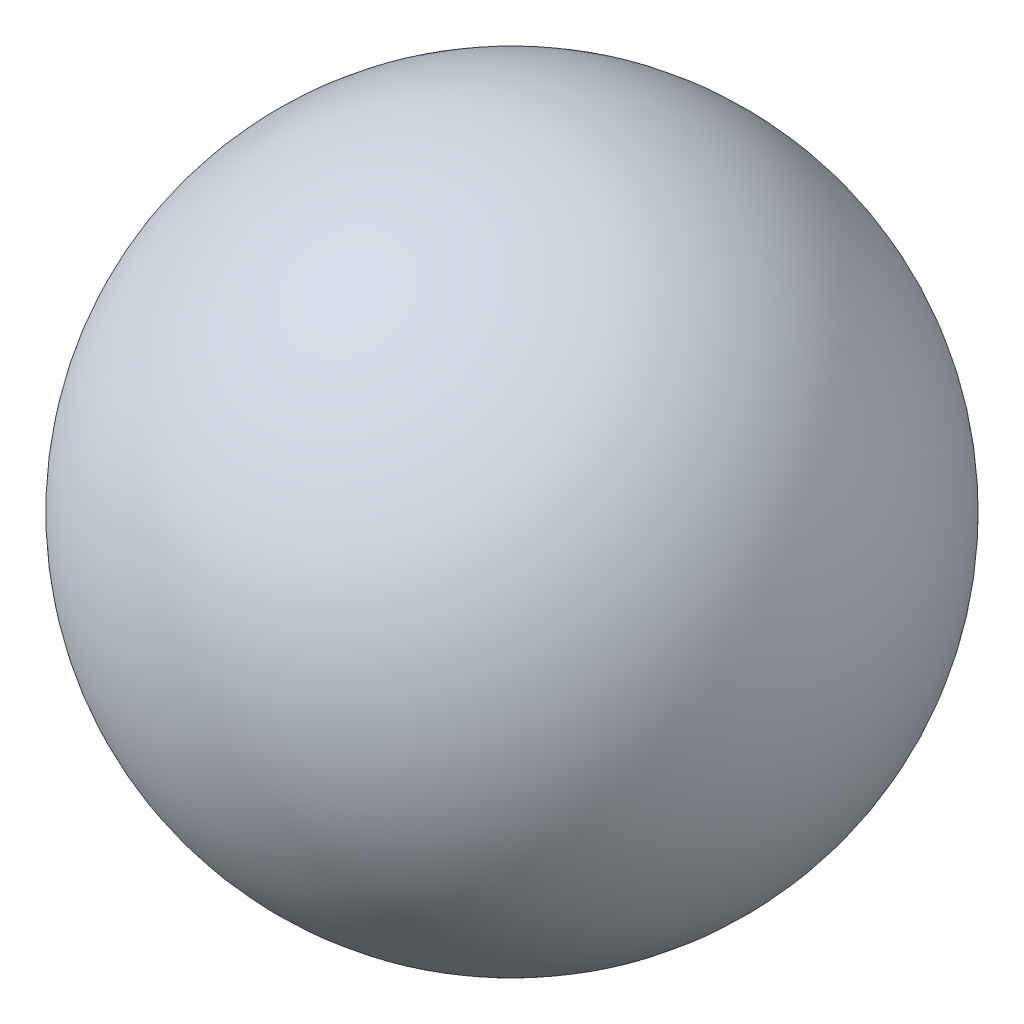
ISO-10303-21;
HEADER;
FILE_DESCRIPTION(('STEP AP214'),'2;1');
FILE_NAME('part.step','',(''),(''),'','','');
FILE_SCHEMA(('AUTOMOTIVE_DESIGN { 1 0 10303 214 1 1 1 1 }'));
ENDSEC;
DATA;
#1=APPLICATION_CONTEXT('core data for automotive mechanical design processes');
#2=APPLICATION_PROTOCOL_DEFINITION('international standard','automotive_design',2000,#1);
#3=PRODUCT_CONTEXT('',#1,'mechanical');
#4=PRODUCT('Part','Part','',(#3));
#5=PRODUCT_RELATED_PRODUCT_CATEGORY('part','',(#4));
#6=PRODUCT_DEFINITION_FORMATION('','',#4);
#7=PRODUCT_DEFINITION_CONTEXT('part definition',#1,'design');
#8=PRODUCT_DEFINITION('design','',#6,#7);
#9=PRODUCT_DEFINITION_SHAPE('','',#8);
#10=(LENGTH_UNIT() NAMED_UNIT(*) SI_UNIT(.MILLI.,.METRE.));
#11=(NAMED_UNIT(*) PLANE_ANGLE_UNIT() SI_UNIT($,.RADIAN.));
#12=(NAMED_UNIT(*) SI_UNIT($,.STERADIAN.) SOLID_ANGLE_UNIT());
#13=UNCERTAINTY_MEASURE_WITH_UNIT(LENGTH_MEASURE(1.E-05),#10,'distance_accuracy_value','');
#14=(GEOMETRIC_REPRESENTATION_CONTEXT(3) GLOBAL_UNCERTAINTY_ASSIGNED_CONTEXT((#13)) GLOBAL_UNIT_ASSIGNED_CONTEXT((#10,
#11,#12)) REPRESENTATION_CONTEXT('',''));
#15=CARTESIAN_POINT('',(0.,0.,0.));
#16=DIRECTION('',(0.,0.,1.));
#17=DIRECTION('',(1.,0.,0.));
#18=AXIS2_PLACEMENT_3D('',#15,#16,#17);
#19=CARTESIAN_POINT('',(0.,123.825,0.));
#20=DIRECTION('',(0.,1.,0.));
#21=DIRECTION('',(0.,0.,1.));
#22=AXIS2_PLACEMENT_3D('',#19,#20,#21);
#23=SPHERICAL_SURFACE('',#22,123.825);
#24=CARTESIAN_POINT('',(0.,247.65,0.));
#25=VERTEX_POINT('',#24);
#26=VERTEX_LOOP('',#25);
#27=FACE_BOUND('',#26,.T.);
#28=ADVANCED_FACE('F32',(#27),#23,.T.);
#29=CLOSED_SHELL('',(#28));
#30=MANIFOLD_SOLID_BREP('B2',#29);
#31=ADVANCED_BREP_SHAPE_REPRESENTATION('',(#18,#30),#14);
#32=SHAPE_DEFINITION_REPRESENTATION(#9,#31);
ENDSEC;
END-ISO-10303-21;
